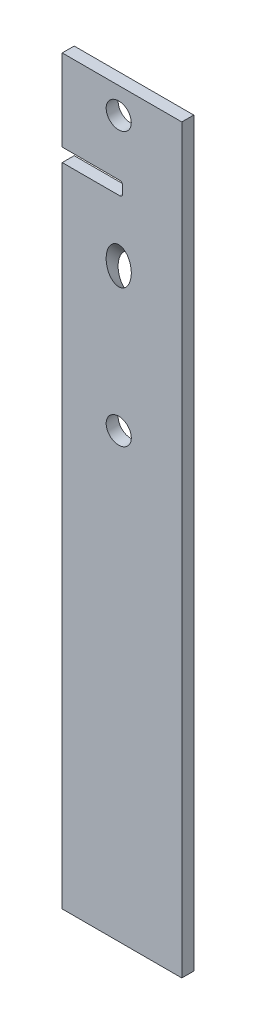
ISO-10303-21;
HEADER;
FILE_DESCRIPTION(('STEP AP214'),'2;1');
FILE_NAME('part.step','',(''),(''),'','','');
FILE_SCHEMA(('AUTOMOTIVE_DESIGN { 1 0 10303 214 1 1 1 1 }'));
ENDSEC;
DATA;
#1=APPLICATION_CONTEXT('core data for automotive mechanical design processes');
#2=APPLICATION_PROTOCOL_DEFINITION('international standard','automotive_design',2000,#1);
#3=PRODUCT_CONTEXT('',#1,'mechanical');
#4=PRODUCT('Part','Part','',(#3));
#5=PRODUCT_RELATED_PRODUCT_CATEGORY('part','',(#4));
#6=PRODUCT_DEFINITION_FORMATION('','',#4);
#7=PRODUCT_DEFINITION_CONTEXT('part definition',#1,'design');
#8=PRODUCT_DEFINITION('design','',#6,#7);
#9=PRODUCT_DEFINITION_SHAPE('','',#8);
#10=(LENGTH_UNIT() NAMED_UNIT(*) SI_UNIT(.MILLI.,.METRE.));
#11=(NAMED_UNIT(*) PLANE_ANGLE_UNIT() SI_UNIT($,.RADIAN.));
#12=(NAMED_UNIT(*) SI_UNIT($,.STERADIAN.) SOLID_ANGLE_UNIT());
#13=UNCERTAINTY_MEASURE_WITH_UNIT(LENGTH_MEASURE(1.E-05),#10,'distance_accuracy_value','');
#14=(GEOMETRIC_REPRESENTATION_CONTEXT(3) GLOBAL_UNCERTAINTY_ASSIGNED_CONTEXT((#13)) GLOBAL_UNIT_ASSIGNED_CONTEXT((#10,
#11,#12)) REPRESENTATION_CONTEXT('',''));
#15=CARTESIAN_POINT('',(0.,0.,0.));
#16=DIRECTION('',(0.,0.,1.));
#17=DIRECTION('',(1.,0.,0.));
#18=AXIS2_PLACEMENT_3D('',#15,#16,#17);
#19=CARTESIAN_POINT('',(2540.,317.5,-143.842086105115));
#20=DIRECTION('',(1.,0.,0.));
#21=DIRECTION('',(0.,0.,-1.));
#22=AXIS2_PLACEMENT_3D('',#19,#20,#21);
#23=PLANE('',#22);
#24=DIRECTION('',(0.,0.,1.));
#25=VECTOR('',#24,1.);
#26=CARTESIAN_POINT('',(2540.,216.638,-143.842086105115));
#27=LINE('',#26,#25);
#28=CARTESIAN_POINT('',(2540.,216.638,-143.842086105115));
#29=VERTEX_POINT('',#28);
#30=CARTESIAN_POINT('',(2540.,216.638,-131.142086105115));
#31=VERTEX_POINT('',#30);
#32=EDGE_CURVE('E159',#29,#31,#27,.T.);
#33=ORIENTED_EDGE('',*,*,#32,.F.);
#34=DIRECTION('',(0.,-1.,0.));
#35=VECTOR('',#34,1.);
#36=CARTESIAN_POINT('',(2540.,317.5,-143.842086105115));
#37=LINE('',#36,#35);
#38=CARTESIAN_POINT('',(2540.,-469.9,-143.842086105115));
#39=VERTEX_POINT('',#38);
#40=EDGE_CURVE('E220',#29,#39,#37,.T.);
#41=ORIENTED_EDGE('',*,*,#40,.T.);
#42=DIRECTION('',(0.,0.,1.));
#43=VECTOR('',#42,1.);
#44=CARTESIAN_POINT('',(2540.,-469.9,-143.842086105115));
#45=LINE('',#44,#43);
#46=CARTESIAN_POINT('',(2540.,-469.9,-131.142086105115));
#47=VERTEX_POINT('',#46);
#48=EDGE_CURVE('E157',#39,#47,#45,.T.);
#49=ORIENTED_EDGE('',*,*,#48,.T.);
#50=DIRECTION('',(0.,-1.,0.));
#51=VECTOR('',#50,1.);
#52=CARTESIAN_POINT('',(2540.,317.5,-131.142086105115));
#53=LINE('',#52,#51);
#54=EDGE_CURVE('E147',#31,#47,#53,.T.);
#55=ORIENTED_EDGE('',*,*,#54,.F.);
#56=EDGE_LOOP('',(#33,#41,#49,#55));
#57=FACE_BOUND('',#56,.T.);
#58=ADVANCED_FACE('F43',(#57),#23,.F.);
#59=CARTESIAN_POINT('',(2540.,317.5,-143.842086105115));
#60=VERTEX_POINT('',#59);
#61=CARTESIAN_POINT('',(2540.,230.862,-143.842086105115));
#62=VERTEX_POINT('',#61);
#63=EDGE_CURVE('E225',#60,#62,#37,.T.);
#64=ORIENTED_EDGE('',*,*,#63,.T.);
#65=DIRECTION('',(0.,0.,1.));
#66=VECTOR('',#65,1.);
#67=CARTESIAN_POINT('',(2540.,230.862,-143.842086105115));
#68=LINE('',#67,#66);
#69=CARTESIAN_POINT('',(2540.,230.862,-131.142086105115));
#70=VERTEX_POINT('',#69);
#71=EDGE_CURVE('E145',#62,#70,#68,.T.);
#72=ORIENTED_EDGE('',*,*,#71,.T.);
#73=CARTESIAN_POINT('',(2540.,317.5,-131.142086105115));
#74=VERTEX_POINT('',#73);
#75=EDGE_CURVE('E125',#74,#70,#53,.T.);
#76=ORIENTED_EDGE('',*,*,#75,.F.);
#77=DIRECTION('',(0.,0.,1.));
#78=VECTOR('',#77,1.);
#79=CARTESIAN_POINT('',(2540.,317.5,-143.842086105115));
#80=LINE('',#79,#78);
#81=EDGE_CURVE('E131',#60,#74,#80,.T.);
#82=ORIENTED_EDGE('',*,*,#81,.F.);
#83=EDGE_LOOP('',(#64,#72,#76,#82));
#84=FACE_BOUND('',#83,.T.);
#85=ADVANCED_FACE('F143',(#84),#23,.F.);
#86=CARTESIAN_POINT('',(2540.,317.5,-131.142086105115));
#87=DIRECTION('',(0.,0.,-1.));
#88=DIRECTION('',(-1.,0.,0.));
#89=AXIS2_PLACEMENT_3D('',#86,#87,#88);
#90=PLANE('',#89);
#91=CARTESIAN_POINT('',(2599.99999999996,289.999999999996,-131.142086105115));
#92=DIRECTION('',(0.,0.,-1.));
#93=DIRECTION('',(-1.,0.,0.));
#94=AXIS2_PLACEMENT_3D('',#91,#92,#93);
#95=CIRCLE('',#94,13.3349999999999);
#96=CARTESIAN_POINT('',(2586.66499999996,289.999999999996,-131.142086105115));
#97=VERTEX_POINT('',#96);
#98=EDGE_CURVE('E178',#97,#97,#95,.F.);
#99=ORIENTED_EDGE('',*,*,#98,.F.);
#100=EDGE_LOOP('',(#99));
#101=FACE_BOUND('',#100,.T.);
#102=ORIENTED_EDGE('',*,*,#75,.T.);
#103=DIRECTION('',(1.,0.,0.));
#104=VECTOR('',#103,1.);
#105=CARTESIAN_POINT('',(2540.,230.862,-131.142086105115));
#106=LINE('',#105,#104);
#107=CARTESIAN_POINT('',(2601.087,230.862,-131.142086105115));
#108=VERTEX_POINT('',#107);
#109=EDGE_CURVE('E158',#70,#108,#106,.T.);
#110=ORIENTED_EDGE('',*,*,#109,.T.);
#111=CARTESIAN_POINT('',(2601.087,227.687,-131.142086105115));
#112=DIRECTION('',(0.,0.,-1.));
#113=DIRECTION('',(-1.,0.,0.));
#114=AXIS2_PLACEMENT_3D('',#111,#112,#113);
#115=CIRCLE('',#114,3.175);
#116=CARTESIAN_POINT('',(2604.262,227.687,-131.142086105115));
#117=VERTEX_POINT('',#116);
#118=EDGE_CURVE('E202',#108,#117,#115,.T.);
#119=ORIENTED_EDGE('',*,*,#118,.T.);
#120=DIRECTION('',(0.,1.,0.));
#121=VECTOR('',#120,1.);
#122=CARTESIAN_POINT('',(2604.262,217.4,-131.142086105115));
#123=LINE('',#122,#121);
#124=CARTESIAN_POINT('',(2604.262,219.813,-131.142086105115));
#125=VERTEX_POINT('',#124);
#126=EDGE_CURVE('E168',#125,#117,#123,.T.);
#127=ORIENTED_EDGE('',*,*,#126,.F.);
#128=CARTESIAN_POINT('',(2601.087,219.813,-131.142086105115));
#129=DIRECTION('',(0.,0.,-1.));
#130=DIRECTION('',(-1.,0.,0.));
#131=AXIS2_PLACEMENT_3D('',#128,#129,#130);
#132=CIRCLE('',#131,3.175);
#133=CARTESIAN_POINT('',(2601.087,216.638,-131.142086105115));
#134=VERTEX_POINT('',#133);
#135=EDGE_CURVE('E12',#125,#134,#132,.T.);
#136=ORIENTED_EDGE('',*,*,#135,.T.);
#137=DIRECTION('',(1.,0.,0.));
#138=VECTOR('',#137,1.);
#139=CARTESIAN_POINT('',(2540.,216.638,-131.142086105115));
#140=LINE('',#139,#138);
#141=EDGE_CURVE('E155',#31,#134,#140,.T.);
#142=ORIENTED_EDGE('',*,*,#141,.F.);
#143=ORIENTED_EDGE('',*,*,#54,.T.);
#144=DIRECTION('',(1.,0.,0.));
#145=VECTOR('',#144,1.);
#146=CARTESIAN_POINT('',(2540.,-469.9,-131.142086105115));
#147=LINE('',#146,#145);
#148=CARTESIAN_POINT('',(2667.,-469.9,-131.142086105115));
#149=VERTEX_POINT('',#148);
#150=EDGE_CURVE('E151',#47,#149,#147,.T.);
#151=ORIENTED_EDGE('',*,*,#150,.T.);
#152=DIRECTION('',(0.,-1.,0.));
#153=VECTOR('',#152,1.);
#154=CARTESIAN_POINT('',(2667.,317.5,-131.142086105115));
#155=LINE('',#154,#153);
#156=CARTESIAN_POINT('',(2667.,317.5,-131.142086105115));
#157=VERTEX_POINT('',#156);
#158=EDGE_CURVE('E127',#157,#149,#155,.T.);
#159=ORIENTED_EDGE('',*,*,#158,.F.);
#160=DIRECTION('',(1.,0.,0.));
#161=VECTOR('',#160,1.);
#162=CARTESIAN_POINT('',(2540.,317.5,-131.142086105115));
#163=LINE('',#162,#161);
#164=EDGE_CURVE('E119',#74,#157,#163,.T.);
#165=ORIENTED_EDGE('',*,*,#164,.F.);
#166=EDGE_LOOP('',(#102,#110,#119,#127,#136,#142,#143,#151,#159,#165));
#167=FACE_BOUND('',#166,.T.);
#168=CARTESIAN_POINT('',(2599.99999999996,-1.09407005656713E-12,-131.142086105115));
#169=DIRECTION('',(0.,0.,-1.));
#170=DIRECTION('',(-1.,0.,0.));
#171=AXIS2_PLACEMENT_3D('',#168,#169,#170);
#172=CIRCLE('',#171,13.3349999999999);
#173=CARTESIAN_POINT('',(2586.66499999996,-1.09407005656713E-12,-131.142086105115));
#174=VERTEX_POINT('',#173);
#175=EDGE_CURVE('E184',#174,#174,#172,.F.);
#176=ORIENTED_EDGE('',*,*,#175,.F.);
#177=EDGE_LOOP('',(#176));
#178=FACE_BOUND('',#177,.T.);
#179=CARTESIAN_POINT('',(2599.99999999996,151.704709198241,-131.142086105115));
#180=DIRECTION('',(0.,0.,-1.));
#181=DIRECTION('',(0.,1.,0.));
#182=AXIS2_PLACEMENT_3D('',#179,#180,#181);
#183=ELLIPSE('',#182,19.379687717848,13.3349999999999);
#184=CARTESIAN_POINT('',(2599.99999999996,171.084396916089,-131.142086105115));
#185=VERTEX_POINT('',#184);
#186=EDGE_CURVE('E170',#185,#185,#183,.F.);
#187=ORIENTED_EDGE('',*,*,#186,.F.);
#188=EDGE_LOOP('',(#187));
#189=FACE_BOUND('',#188,.T.);
#190=ADVANCED_FACE('F121',(#101,#167,#178,#189),#90,.F.);
#191=CARTESIAN_POINT('',(2667.,317.5,-143.842086105115));
#192=DIRECTION('',(-1.,0.,0.));
#193=DIRECTION('',(0.,0.,1.));
#194=AXIS2_PLACEMENT_3D('',#191,#192,#193);
#195=PLANE('',#194);
#196=DIRECTION('',(0.,0.,-1.));
#197=VECTOR('',#196,1.);
#198=CARTESIAN_POINT('',(2667.,-469.9,-143.842086105115));
#199=LINE('',#198,#197);
#200=CARTESIAN_POINT('',(2667.,-469.9,-143.842086105115));
#201=VERTEX_POINT('',#200);
#202=EDGE_CURVE('E146',#149,#201,#199,.T.);
#203=ORIENTED_EDGE('',*,*,#202,.T.);
#204=DIRECTION('',(0.,-1.,0.));
#205=VECTOR('',#204,1.);
#206=CARTESIAN_POINT('',(2667.,317.5,-143.842086105115));
#207=LINE('',#206,#205);
#208=CARTESIAN_POINT('',(2667.,317.5,-143.842086105115));
#209=VERTEX_POINT('',#208);
#210=EDGE_CURVE('E140',#209,#201,#207,.T.);
#211=ORIENTED_EDGE('',*,*,#210,.F.);
#212=DIRECTION('',(0.,0.,-1.));
#213=VECTOR('',#212,1.);
#214=CARTESIAN_POINT('',(2667.,317.5,-143.842086105115));
#215=LINE('',#214,#213);
#216=EDGE_CURVE('E130',#157,#209,#215,.T.);
#217=ORIENTED_EDGE('',*,*,#216,.F.);
#218=ORIENTED_EDGE('',*,*,#158,.T.);
#219=EDGE_LOOP('',(#203,#211,#217,#218));
#220=FACE_BOUND('',#219,.T.);
#221=ADVANCED_FACE('F235',(#220),#195,.F.);
#222=CARTESIAN_POINT('',(2540.,317.5,-143.842086105115));
#223=DIRECTION('',(0.,0.,1.));
#224=DIRECTION('',(1.,0.,0.));
#225=AXIS2_PLACEMENT_3D('',#222,#223,#224);
#226=PLANE('',#225);
#227=CARTESIAN_POINT('',(2599.99999999996,289.999999999996,-143.842086105115));
#228=DIRECTION('',(0.,0.,1.));
#229=DIRECTION('',(1.,0.,0.));
#230=AXIS2_PLACEMENT_3D('',#227,#228,#229);
#231=CIRCLE('',#230,13.3349999999999);
#232=CARTESIAN_POINT('',(2613.33499999996,289.999999999996,-143.842086105115));
#233=VERTEX_POINT('',#232);
#234=EDGE_CURVE('E181',#233,#233,#231,.F.);
#235=ORIENTED_EDGE('',*,*,#234,.F.);
#236=EDGE_LOOP('',(#235));
#237=FACE_BOUND('',#236,.T.);
#238=ORIENTED_EDGE('',*,*,#210,.T.);
#239=DIRECTION('',(-1.,0.,0.));
#240=VECTOR('',#239,1.);
#241=CARTESIAN_POINT('',(2540.,-469.9,-143.842086105115));
#242=LINE('',#241,#240);
#243=EDGE_CURVE('E231',#201,#39,#242,.T.);
#244=ORIENTED_EDGE('',*,*,#243,.T.);
#245=ORIENTED_EDGE('',*,*,#40,.F.);
#246=DIRECTION('',(-1.,0.,0.));
#247=VECTOR('',#246,1.);
#248=CARTESIAN_POINT('',(2540.,216.638,-143.842086105115));
#249=LINE('',#248,#247);
#250=CARTESIAN_POINT('',(2601.087,216.638,-143.842086105115));
#251=VERTEX_POINT('',#250);
#252=EDGE_CURVE('E162',#251,#29,#249,.T.);
#253=ORIENTED_EDGE('',*,*,#252,.F.);
#254=CARTESIAN_POINT('',(2601.087,219.813,-143.842086105115));
#255=DIRECTION('',(0.,0.,1.));
#256=DIRECTION('',(1.,0.,0.));
#257=AXIS2_PLACEMENT_3D('',#254,#255,#256);
#258=CIRCLE('',#257,3.175);
#259=CARTESIAN_POINT('',(2604.262,219.813,-143.842086105115));
#260=VERTEX_POINT('',#259);
#261=EDGE_CURVE('E51',#251,#260,#258,.T.);
#262=ORIENTED_EDGE('',*,*,#261,.T.);
#263=DIRECTION('',(0.,1.,0.));
#264=VECTOR('',#263,1.);
#265=CARTESIAN_POINT('',(2604.262,317.5,-143.842086105115));
#266=LINE('',#265,#264);
#267=CARTESIAN_POINT('',(2604.262,227.687,-143.842086105115));
#268=VERTEX_POINT('',#267);
#269=EDGE_CURVE('E161',#260,#268,#266,.T.);
#270=ORIENTED_EDGE('',*,*,#269,.T.);
#271=CARTESIAN_POINT('',(2601.087,227.687,-143.842086105115));
#272=DIRECTION('',(0.,0.,1.));
#273=DIRECTION('',(1.,0.,0.));
#274=AXIS2_PLACEMENT_3D('',#271,#272,#273);
#275=CIRCLE('',#274,3.175);
#276=CARTESIAN_POINT('',(2601.087,230.862,-143.842086105115));
#277=VERTEX_POINT('',#276);
#278=EDGE_CURVE('E200',#268,#277,#275,.T.);
#279=ORIENTED_EDGE('',*,*,#278,.T.);
#280=DIRECTION('',(-1.,0.,0.));
#281=VECTOR('',#280,1.);
#282=CARTESIAN_POINT('',(2540.,230.862,-143.842086105115));
#283=LINE('',#282,#281);
#284=EDGE_CURVE('E165',#277,#62,#283,.T.);
#285=ORIENTED_EDGE('',*,*,#284,.T.);
#286=ORIENTED_EDGE('',*,*,#63,.F.);
#287=DIRECTION('',(-1.,0.,0.));
#288=VECTOR('',#287,1.);
#289=CARTESIAN_POINT('',(2540.,317.5,-143.842086105115));
#290=LINE('',#289,#288);
#291=EDGE_CURVE('E136',#209,#60,#290,.T.);
#292=ORIENTED_EDGE('',*,*,#291,.F.);
#293=EDGE_LOOP('',(#238,#244,#245,#253,#262,#270,#279,#285,#286,#292));
#294=FACE_BOUND('',#293,.T.);
#295=CARTESIAN_POINT('',(2599.99999999996,138.311981925514,-143.842086105115));
#296=DIRECTION('',(0.,0.,1.));
#297=DIRECTION('',(0.,1.,0.));
#298=AXIS2_PLACEMENT_3D('',#295,#296,#297);
#299=ELLIPSE('',#298,19.379687717848,13.3349999999999);
#300=CARTESIAN_POINT('',(2599.99999999996,157.691669643362,-143.842086105115));
#301=VERTEX_POINT('',#300);
#302=EDGE_CURVE('E175',#301,#301,#299,.F.);
#303=ORIENTED_EDGE('',*,*,#302,.F.);
#304=EDGE_LOOP('',(#303));
#305=FACE_BOUND('',#304,.T.);
#306=CARTESIAN_POINT('',(2599.99999999996,-9.97483853262698E-13,-143.842086105115));
#307=DIRECTION('',(0.,0.,1.));
#308=DIRECTION('',(1.,0.,0.));
#309=AXIS2_PLACEMENT_3D('',#306,#307,#308);
#310=CIRCLE('',#309,13.3349999999999);
#311=CARTESIAN_POINT('',(2613.33499999996,-9.97483853262698E-13,-143.842086105115));
#312=VERTEX_POINT('',#311);
#313=EDGE_CURVE('E187',#312,#312,#310,.F.);
#314=ORIENTED_EDGE('',*,*,#313,.F.);
#315=EDGE_LOOP('',(#314));
#316=FACE_BOUND('',#315,.T.);
#317=ADVANCED_FACE('F206',(#237,#294,#305,#316),#226,.F.);
#318=CARTESIAN_POINT('',(0.,317.5,0.));
#319=DIRECTION('',(0.,1.,0.));
#320=DIRECTION('',(0.,0.,1.));
#321=AXIS2_PLACEMENT_3D('',#318,#319,#320);
#322=PLANE('',#321);
#323=ORIENTED_EDGE('',*,*,#81,.T.);
#324=ORIENTED_EDGE('',*,*,#164,.T.);
#325=ORIENTED_EDGE('',*,*,#216,.T.);
#326=ORIENTED_EDGE('',*,*,#291,.T.);
#327=EDGE_LOOP('',(#323,#324,#325,#326));
#328=FACE_BOUND('',#327,.T.);
#329=ADVANCED_FACE('F134',(#328),#322,.T.);
#330=CARTESIAN_POINT('',(0.,-469.9,0.));
#331=DIRECTION('',(0.,1.,0.));
#332=DIRECTION('',(0.,0.,1.));
#333=AXIS2_PLACEMENT_3D('',#330,#331,#332);
#334=PLANE('',#333);
#335=ORIENTED_EDGE('',*,*,#48,.F.);
#336=ORIENTED_EDGE('',*,*,#243,.F.);
#337=ORIENTED_EDGE('',*,*,#202,.F.);
#338=ORIENTED_EDGE('',*,*,#150,.F.);
#339=EDGE_LOOP('',(#335,#336,#337,#338));
#340=FACE_BOUND('',#339,.T.);
#341=ADVANCED_FACE('F236',(#340),#334,.F.);
#342=CARTESIAN_POINT('',(2599.99999999996,0.,-275.000000000001));
#343=DIRECTION('',(0.,0.,1.));
#344=DIRECTION('',(0.,-1.,0.));
#345=AXIS2_PLACEMENT_3D('',#342,#343,#344);
#346=CYLINDRICAL_SURFACE('',#345,13.3349999999999);
#347=ORIENTED_EDGE('',*,*,#313,.T.);
#348=EDGE_LOOP('',(#347));
#349=FACE_BOUND('',#348,.T.);
#350=ORIENTED_EDGE('',*,*,#175,.T.);
#351=EDGE_LOOP('',(#350));
#352=FACE_BOUND('',#351,.T.);
#353=ADVANCED_FACE('F238',(#349,#352),#346,.F.);
#354=CARTESIAN_POINT('',(2599.99999999996,289.999999999996,275.));
#355=DIRECTION('',(0.,0.,-1.));
#356=DIRECTION('',(0.,1.,0.));
#357=AXIS2_PLACEMENT_3D('',#354,#355,#356);
#358=CYLINDRICAL_SURFACE('',#357,13.3349999999999);
#359=ORIENTED_EDGE('',*,*,#234,.T.);
#360=EDGE_LOOP('',(#359));
#361=FACE_BOUND('',#360,.T.);
#362=ORIENTED_EDGE('',*,*,#98,.T.);
#363=EDGE_LOOP('',(#362));
#364=FACE_BOUND('',#363,.T.);
#365=ADVANCED_FACE('F244',(#361,#364),#358,.F.);
#366=CARTESIAN_POINT('',(2599.99999999996,0.,-275.000000000001));
#367=DIRECTION('',(0.,0.725623851173429,0.688091583009297));
#368=DIRECTION('',(0.,-0.688091583009297,0.725623851173429));
#369=AXIS2_PLACEMENT_3D('',#366,#367,#368);
#370=CYLINDRICAL_SURFACE('',#369,13.3349999999999);
#371=ORIENTED_EDGE('',*,*,#302,.T.);
#372=EDGE_LOOP('',(#371));
#373=FACE_BOUND('',#372,.T.);
#374=ORIENTED_EDGE('',*,*,#186,.T.);
#375=EDGE_LOOP('',(#374));
#376=FACE_BOUND('',#375,.T.);
#377=ADVANCED_FACE('F264',(#373,#376),#370,.F.);
#378=CARTESIAN_POINT('',(0.,216.638,0.));
#379=DIRECTION('',(0.,1.,0.));
#380=DIRECTION('',(0.,0.,1.));
#381=AXIS2_PLACEMENT_3D('',#378,#379,#380);
#382=PLANE('',#381);
#383=ORIENTED_EDGE('',*,*,#141,.T.);
#384=DIRECTION('',(0.,0.,-1.));
#385=VECTOR('',#384,1.);
#386=CARTESIAN_POINT('',(2601.08699999999,216.638,9.09539110693912E-11));
#387=LINE('',#386,#385);
#388=EDGE_CURVE('E198',#134,#251,#387,.T.);
#389=ORIENTED_EDGE('',*,*,#388,.T.);
#390=ORIENTED_EDGE('',*,*,#252,.T.);
#391=ORIENTED_EDGE('',*,*,#32,.T.);
#392=EDGE_LOOP('',(#383,#389,#390,#391));
#393=FACE_BOUND('',#392,.T.);
#394=ADVANCED_FACE('F213',(#393),#382,.T.);
#395=CARTESIAN_POINT('',(0.,230.862,0.));
#396=DIRECTION('',(0.,1.,0.));
#397=DIRECTION('',(0.,0.,1.));
#398=AXIS2_PLACEMENT_3D('',#395,#396,#397);
#399=PLANE('',#398);
#400=ORIENTED_EDGE('',*,*,#284,.F.);
#401=DIRECTION('',(0.,0.,-1.));
#402=VECTOR('',#401,1.);
#403=CARTESIAN_POINT('',(2601.087,230.862,-131.142086105115));
#404=LINE('',#403,#402);
#405=EDGE_CURVE('E196',#277,#108,#404,.F.);
#406=ORIENTED_EDGE('',*,*,#405,.T.);
#407=ORIENTED_EDGE('',*,*,#109,.F.);
#408=ORIENTED_EDGE('',*,*,#71,.F.);
#409=EDGE_LOOP('',(#400,#406,#407,#408));
#410=FACE_BOUND('',#409,.T.);
#411=ADVANCED_FACE('F263',(#410),#399,.F.);
#412=CARTESIAN_POINT('',(2604.262,217.4,-131.142086105114));
#413=DIRECTION('',(1.,0.,0.));
#414=DIRECTION('',(0.,0.,-1.));
#415=AXIS2_PLACEMENT_3D('',#412,#413,#414);
#416=PLANE('',#415);
#417=ORIENTED_EDGE('',*,*,#126,.T.);
#418=DIRECTION('',(0.,0.,-1.));
#419=VECTOR('',#418,1.);
#420=CARTESIAN_POINT('',(2604.262,227.687,-143.842086105115));
#421=LINE('',#420,#419);
#422=EDGE_CURVE('E193',#117,#268,#421,.T.);
#423=ORIENTED_EDGE('',*,*,#422,.T.);
#424=ORIENTED_EDGE('',*,*,#269,.F.);
#425=DIRECTION('',(0.,0.,-1.));
#426=VECTOR('',#425,1.);
#427=CARTESIAN_POINT('',(2604.262,219.813,-131.142086105114));
#428=LINE('',#427,#426);
#429=EDGE_CURVE('E164',#260,#125,#428,.F.);
#430=ORIENTED_EDGE('',*,*,#429,.T.);
#431=EDGE_LOOP('',(#417,#423,#424,#430));
#432=FACE_BOUND('',#431,.T.);
#433=ADVANCED_FACE('F210',(#432),#416,.F.);
#434=CARTESIAN_POINT('',(2601.087,227.687,-131.142086105115));
#435=DIRECTION('',(0.,0.,1.));
#436=DIRECTION('',(1.,0.,0.));
#437=AXIS2_PLACEMENT_3D('',#434,#435,#436);
#438=CYLINDRICAL_SURFACE('',#437,3.175);
#439=ORIENTED_EDGE('',*,*,#118,.F.);
#440=ORIENTED_EDGE('',*,*,#405,.F.);
#441=ORIENTED_EDGE('',*,*,#278,.F.);
#442=ORIENTED_EDGE('',*,*,#422,.F.);
#443=EDGE_LOOP('',(#439,#440,#441,#442));
#444=FACE_BOUND('',#443,.T.);
#445=ADVANCED_FACE('F267',(#444),#438,.F.);
#446=CARTESIAN_POINT('',(2601.08699999999,219.813,9.09539110693912E-11));
#447=DIRECTION('',(0.,0.,-1.));
#448=DIRECTION('',(-1.,0.,0.));
#449=AXIS2_PLACEMENT_3D('',#446,#447,#448);
#450=CYLINDRICAL_SURFACE('',#449,3.175);
#451=ORIENTED_EDGE('',*,*,#135,.F.);
#452=ORIENTED_EDGE('',*,*,#429,.F.);
#453=ORIENTED_EDGE('',*,*,#261,.F.);
#454=ORIENTED_EDGE('',*,*,#388,.F.);
#455=EDGE_LOOP('',(#451,#452,#453,#454));
#456=FACE_BOUND('',#455,.T.);
#457=ADVANCED_FACE('F45',(#456),#450,.F.);
#458=CLOSED_SHELL('',(#58,#85,#190,#221,#317,#329,#341,#353,#365,#377,#394,#411,#433,#445,#457));
#459=MANIFOLD_SOLID_BREP('B2',#458);
#460=ADVANCED_BREP_SHAPE_REPRESENTATION('',(#18,#459),#14);
#461=SHAPE_DEFINITION_REPRESENTATION(#9,#460);
ENDSEC;
END-ISO-10303-21;
